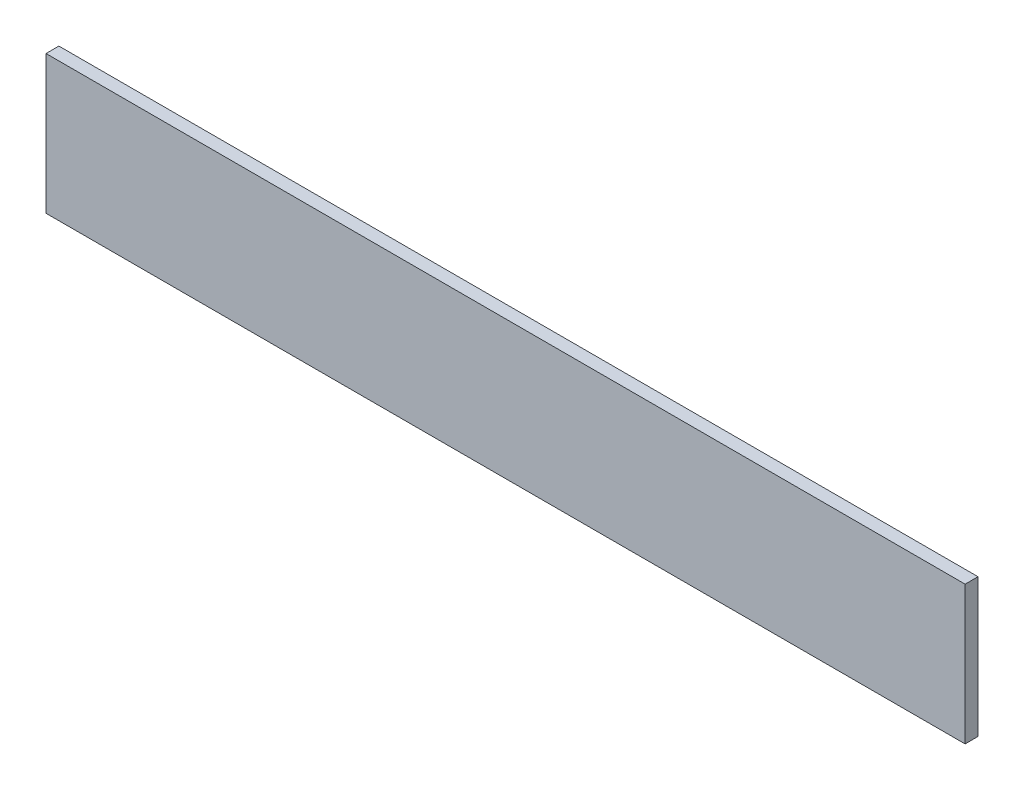
ISO-10303-21;
HEADER;
FILE_DESCRIPTION(('STEP AP214'),'2;1');
FILE_NAME('part.step','',(''),(''),'','','');
FILE_SCHEMA(('AUTOMOTIVE_DESIGN { 1 0 10303 214 1 1 1 1 }'));
ENDSEC;
DATA;
#1=APPLICATION_CONTEXT('core data for automotive mechanical design processes');
#2=APPLICATION_PROTOCOL_DEFINITION('international standard','automotive_design',2000,#1);
#3=PRODUCT_CONTEXT('',#1,'mechanical');
#4=PRODUCT('Part','Part','',(#3));
#5=PRODUCT_RELATED_PRODUCT_CATEGORY('part','',(#4));
#6=PRODUCT_DEFINITION_FORMATION('','',#4);
#7=PRODUCT_DEFINITION_CONTEXT('part definition',#1,'design');
#8=PRODUCT_DEFINITION('design','',#6,#7);
#9=PRODUCT_DEFINITION_SHAPE('','',#8);
#10=(LENGTH_UNIT() NAMED_UNIT(*) SI_UNIT(.MILLI.,.METRE.));
#11=(NAMED_UNIT(*) PLANE_ANGLE_UNIT() SI_UNIT($,.RADIAN.));
#12=(NAMED_UNIT(*) SI_UNIT($,.STERADIAN.) SOLID_ANGLE_UNIT());
#13=UNCERTAINTY_MEASURE_WITH_UNIT(LENGTH_MEASURE(1.E-05),#10,'distance_accuracy_value','');
#14=(GEOMETRIC_REPRESENTATION_CONTEXT(3) GLOBAL_UNCERTAINTY_ASSIGNED_CONTEXT((#13)) GLOBAL_UNIT_ASSIGNED_CONTEXT((#10,
#11,#12)) REPRESENTATION_CONTEXT('',''));
#15=CARTESIAN_POINT('',(0.,0.,0.));
#16=DIRECTION('',(0.,0.,1.));
#17=DIRECTION('',(1.,0.,0.));
#18=AXIS2_PLACEMENT_3D('',#15,#16,#17);
#19=CARTESIAN_POINT('',(-204.770642201835,126.559633027523,5.));
#20=DIRECTION('',(1.,0.,0.));
#21=DIRECTION('',(0.,1.,0.));
#22=AXIS2_PLACEMENT_3D('',#19,#20,#21);
#23=PLANE('',#22);
#24=DIRECTION('',(0.,-1.,0.));
#25=VECTOR('',#24,1.);
#26=CARTESIAN_POINT('',(-204.770642201835,126.559633027523,0.));
#27=LINE('',#26,#25);
#28=CARTESIAN_POINT('',(-204.770642201835,126.559633027523,0.));
#29=VERTEX_POINT('',#28);
#30=CARTESIAN_POINT('',(-204.770642201835,72.8796330275229,0.));
#31=VERTEX_POINT('',#30);
#32=EDGE_CURVE('E100',#29,#31,#27,.T.);
#33=ORIENTED_EDGE('',*,*,#32,.T.);
#34=DIRECTION('',(0.,0.,-1.));
#35=VECTOR('',#34,1.);
#36=CARTESIAN_POINT('',(-204.770642201835,72.8796330275229,5.));
#37=LINE('',#36,#35);
#38=CARTESIAN_POINT('',(-204.770642201835,72.8796330275229,5.));
#39=VERTEX_POINT('',#38);
#40=EDGE_CURVE('E11',#39,#31,#37,.T.);
#41=ORIENTED_EDGE('',*,*,#40,.F.);
#42=DIRECTION('',(0.,-1.,0.));
#43=VECTOR('',#42,1.);
#44=CARTESIAN_POINT('',(-204.770642201835,126.559633027523,5.));
#45=LINE('',#44,#43);
#46=CARTESIAN_POINT('',(-204.770642201835,126.559633027523,5.));
#47=VERTEX_POINT('',#46);
#48=EDGE_CURVE('E88',#47,#39,#45,.T.);
#49=ORIENTED_EDGE('',*,*,#48,.F.);
#50=DIRECTION('',(0.,0.,-1.));
#51=VECTOR('',#50,1.);
#52=CARTESIAN_POINT('',(-204.770642201835,126.559633027523,5.));
#53=LINE('',#52,#51);
#54=EDGE_CURVE('E96',#47,#29,#53,.T.);
#55=ORIENTED_EDGE('',*,*,#54,.T.);
#56=EDGE_LOOP('',(#33,#41,#49,#55));
#57=FACE_BOUND('',#56,.T.);
#58=ADVANCED_FACE('F37',(#57),#23,.F.);
#59=CARTESIAN_POINT('',(-204.770642201835,72.8796330275229,5.));
#60=DIRECTION('',(0.,1.,0.));
#61=DIRECTION('',(0.,0.,1.));
#62=AXIS2_PLACEMENT_3D('',#59,#60,#61);
#63=PLANE('',#62);
#64=DIRECTION('',(1.,0.,0.));
#65=VECTOR('',#64,1.);
#66=CARTESIAN_POINT('',(-204.770642201835,72.8796330275229,0.));
#67=LINE('',#66,#65);
#68=CARTESIAN_POINT('',(151.729357798165,72.8796330275229,0.));
#69=VERTEX_POINT('',#68);
#70=EDGE_CURVE('E92',#31,#69,#67,.T.);
#71=ORIENTED_EDGE('',*,*,#70,.T.);
#72=DIRECTION('',(0.,0.,-1.));
#73=VECTOR('',#72,1.);
#74=CARTESIAN_POINT('',(151.729357798165,72.8796330275229,5.));
#75=LINE('',#74,#73);
#76=CARTESIAN_POINT('',(151.729357798165,72.8796330275229,5.));
#77=VERTEX_POINT('',#76);
#78=EDGE_CURVE('E45',#77,#69,#75,.T.);
#79=ORIENTED_EDGE('',*,*,#78,.F.);
#80=DIRECTION('',(1.,0.,0.));
#81=VECTOR('',#80,1.);
#82=CARTESIAN_POINT('',(-204.770642201835,72.8796330275229,5.));
#83=LINE('',#82,#81);
#84=EDGE_CURVE('E83',#39,#77,#83,.T.);
#85=ORIENTED_EDGE('',*,*,#84,.F.);
#86=ORIENTED_EDGE('',*,*,#40,.T.);
#87=EDGE_LOOP('',(#71,#79,#85,#86));
#88=FACE_BOUND('',#87,.T.);
#89=ADVANCED_FACE('F91',(#88),#63,.F.);
#90=CARTESIAN_POINT('',(151.729357798165,126.559633027523,5.));
#91=DIRECTION('',(-1.,0.,0.));
#92=DIRECTION('',(0.,-1.,0.));
#93=AXIS2_PLACEMENT_3D('',#90,#91,#92);
#94=PLANE('',#93);
#95=DIRECTION('',(0.,1.,0.));
#96=VECTOR('',#95,1.);
#97=CARTESIAN_POINT('',(151.729357798165,126.559633027523,0.));
#98=LINE('',#97,#96);
#99=CARTESIAN_POINT('',(151.729357798165,126.559633027523,0.));
#100=VERTEX_POINT('',#99);
#101=EDGE_CURVE('E70',#69,#100,#98,.T.);
#102=ORIENTED_EDGE('',*,*,#101,.T.);
#103=DIRECTION('',(0.,0.,-1.));
#104=VECTOR('',#103,1.);
#105=CARTESIAN_POINT('',(151.729357798165,126.559633027523,5.));
#106=LINE('',#105,#104);
#107=CARTESIAN_POINT('',(151.729357798165,126.559633027523,5.));
#108=VERTEX_POINT('',#107);
#109=EDGE_CURVE('E93',#108,#100,#106,.T.);
#110=ORIENTED_EDGE('',*,*,#109,.F.);
#111=DIRECTION('',(0.,1.,0.));
#112=VECTOR('',#111,1.);
#113=CARTESIAN_POINT('',(151.729357798165,126.559633027523,5.));
#114=LINE('',#113,#112);
#115=EDGE_CURVE('E86',#77,#108,#114,.T.);
#116=ORIENTED_EDGE('',*,*,#115,.F.);
#117=ORIENTED_EDGE('',*,*,#78,.T.);
#118=EDGE_LOOP('',(#102,#110,#116,#117));
#119=FACE_BOUND('',#118,.T.);
#120=ADVANCED_FACE('F94',(#119),#94,.F.);
#121=CARTESIAN_POINT('',(-204.770642201835,126.559633027523,5.));
#122=DIRECTION('',(0.,-1.,0.));
#123=DIRECTION('',(0.,0.,-1.));
#124=AXIS2_PLACEMENT_3D('',#121,#122,#123);
#125=PLANE('',#124);
#126=DIRECTION('',(-1.,0.,0.));
#127=VECTOR('',#126,1.);
#128=CARTESIAN_POINT('',(-204.770642201835,126.559633027523,0.));
#129=LINE('',#128,#127);
#130=EDGE_CURVE('E76',#100,#29,#129,.T.);
#131=ORIENTED_EDGE('',*,*,#130,.T.);
#132=ORIENTED_EDGE('',*,*,#54,.F.);
#133=DIRECTION('',(-1.,0.,0.));
#134=VECTOR('',#133,1.);
#135=CARTESIAN_POINT('',(-204.770642201835,126.559633027523,5.));
#136=LINE('',#135,#134);
#137=EDGE_CURVE('E53',#108,#47,#136,.T.);
#138=ORIENTED_EDGE('',*,*,#137,.F.);
#139=ORIENTED_EDGE('',*,*,#109,.T.);
#140=EDGE_LOOP('',(#131,#132,#138,#139));
#141=FACE_BOUND('',#140,.T.);
#142=ADVANCED_FACE('F107',(#141),#125,.F.);
#143=CARTESIAN_POINT('',(0.,0.,5.));
#144=DIRECTION('',(0.,0.,1.));
#145=DIRECTION('',(1.,0.,0.));
#146=AXIS2_PLACEMENT_3D('',#143,#144,#145);
#147=PLANE('',#146);
#148=ORIENTED_EDGE('',*,*,#48,.T.);
#149=ORIENTED_EDGE('',*,*,#84,.T.);
#150=ORIENTED_EDGE('',*,*,#115,.T.);
#151=ORIENTED_EDGE('',*,*,#137,.T.);
#152=EDGE_LOOP('',(#148,#149,#150,#151));
#153=FACE_BOUND('',#152,.T.);
#154=ADVANCED_FACE('F84',(#153),#147,.T.);
#155=CARTESIAN_POINT('',(0.,0.,0.));
#156=DIRECTION('',(0.,0.,1.));
#157=DIRECTION('',(1.,0.,0.));
#158=AXIS2_PLACEMENT_3D('',#155,#156,#157);
#159=PLANE('',#158);
#160=ORIENTED_EDGE('',*,*,#32,.F.);
#161=ORIENTED_EDGE('',*,*,#130,.F.);
#162=ORIENTED_EDGE('',*,*,#101,.F.);
#163=ORIENTED_EDGE('',*,*,#70,.F.);
#164=EDGE_LOOP('',(#160,#161,#162,#163));
#165=FACE_BOUND('',#164,.T.);
#166=ADVANCED_FACE('F110',(#165),#159,.F.);
#167=CLOSED_SHELL('',(#58,#89,#120,#142,#154,#166));
#168=MANIFOLD_SOLID_BREP('B2',#167);
#169=ADVANCED_BREP_SHAPE_REPRESENTATION('',(#18,#168),#14);
#170=SHAPE_DEFINITION_REPRESENTATION(#9,#169);
ENDSEC;
END-ISO-10303-21;
